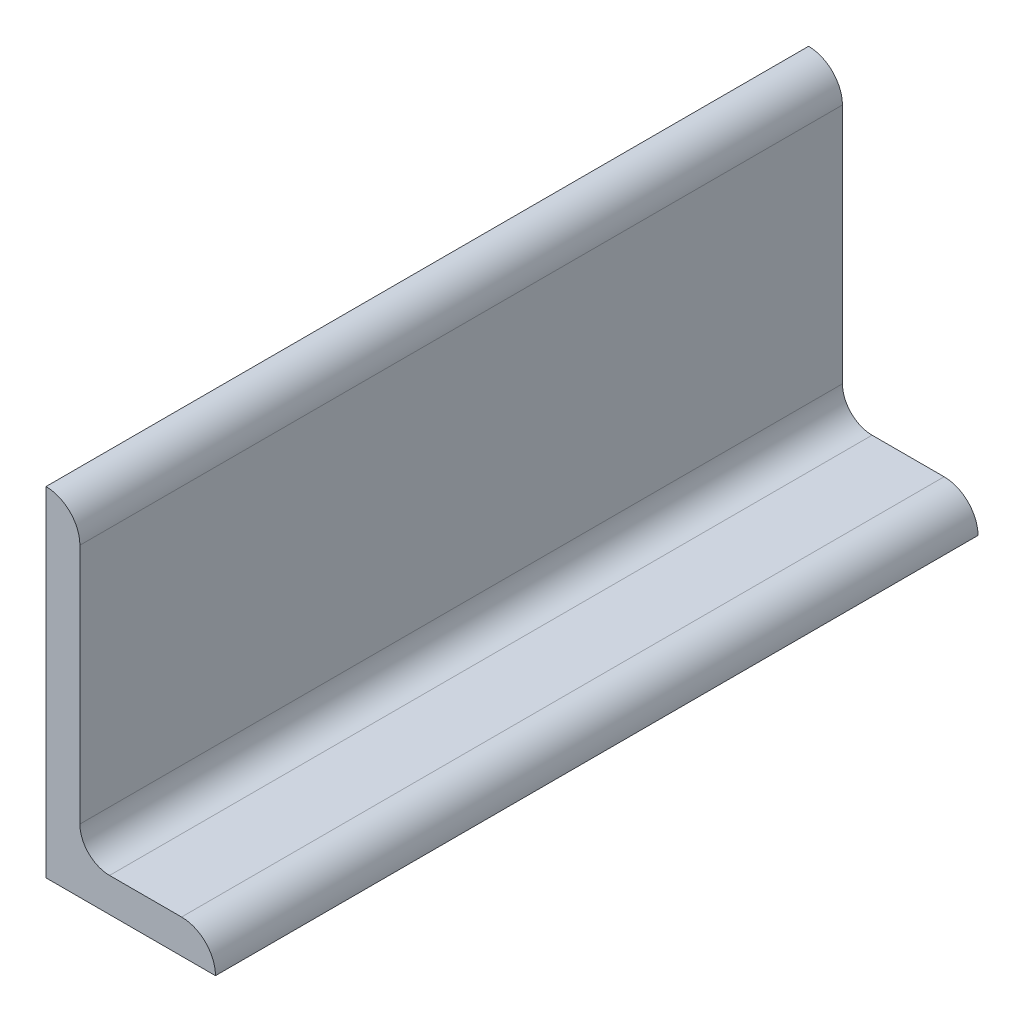
ISO-10303-21;
HEADER;
FILE_DESCRIPTION(('STEP AP214'),'2;1');
FILE_NAME('part.step','',(''),(''),'','','');
FILE_SCHEMA(('AUTOMOTIVE_DESIGN { 1 0 10303 214 1 1 1 1 }'));
ENDSEC;
DATA;
#1=APPLICATION_CONTEXT('core data for automotive mechanical design processes');
#2=APPLICATION_PROTOCOL_DEFINITION('international standard','automotive_design',2000,#1);
#3=PRODUCT_CONTEXT('',#1,'mechanical');
#4=PRODUCT('Part','Part','',(#3));
#5=PRODUCT_RELATED_PRODUCT_CATEGORY('part','',(#4));
#6=PRODUCT_DEFINITION_FORMATION('','',#4);
#7=PRODUCT_DEFINITION_CONTEXT('part definition',#1,'design');
#8=PRODUCT_DEFINITION('design','',#6,#7);
#9=PRODUCT_DEFINITION_SHAPE('','',#8);
#10=(LENGTH_UNIT() NAMED_UNIT(*) SI_UNIT(.MILLI.,.METRE.));
#11=(NAMED_UNIT(*) PLANE_ANGLE_UNIT() SI_UNIT($,.RADIAN.));
#12=(NAMED_UNIT(*) SI_UNIT($,.STERADIAN.) SOLID_ANGLE_UNIT());
#13=UNCERTAINTY_MEASURE_WITH_UNIT(LENGTH_MEASURE(1.E-05),#10,'distance_accuracy_value','');
#14=(GEOMETRIC_REPRESENTATION_CONTEXT(3) GLOBAL_UNCERTAINTY_ASSIGNED_CONTEXT((#13)) GLOBAL_UNIT_ASSIGNED_CONTEXT((#10,
#11,#12)) REPRESENTATION_CONTEXT('',''));
#15=CARTESIAN_POINT('',(0.,0.,0.));
#16=DIRECTION('',(0.,0.,1.));
#17=DIRECTION('',(1.,0.,0.));
#18=AXIS2_PLACEMENT_3D('',#15,#16,#17);
#19=CARTESIAN_POINT('',(40.,0.,90.));
#20=DIRECTION('',(0.,1.,0.));
#21=DIRECTION('',(-1.,0.,0.));
#22=AXIS2_PLACEMENT_3D('',#19,#20,#21);
#23=PLANE('',#22);
#24=DIRECTION('',(1.,0.,0.));
#25=VECTOR('',#24,1.);
#26=CARTESIAN_POINT('',(40.,0.,-90.));
#27=LINE('',#26,#25);
#28=CARTESIAN_POINT('',(0.,0.,-90.));
#29=VERTEX_POINT('',#28);
#30=CARTESIAN_POINT('',(40.,0.,-90.));
#31=VERTEX_POINT('',#30);
#32=EDGE_CURVE('E106',#29,#31,#27,.T.);
#33=ORIENTED_EDGE('',*,*,#32,.T.);
#34=DIRECTION('',(0.,0.,-1.));
#35=VECTOR('',#34,1.);
#36=CARTESIAN_POINT('',(40.,0.,90.));
#37=LINE('',#36,#35);
#38=CARTESIAN_POINT('',(40.,0.,90.));
#39=VERTEX_POINT('',#38);
#40=EDGE_CURVE('E104',#39,#31,#37,.T.);
#41=ORIENTED_EDGE('',*,*,#40,.F.);
#42=DIRECTION('',(1.,0.,0.));
#43=VECTOR('',#42,1.);
#44=CARTESIAN_POINT('',(40.,0.,90.));
#45=LINE('',#44,#43);
#46=CARTESIAN_POINT('',(0.,0.,90.));
#47=VERTEX_POINT('',#46);
#48=EDGE_CURVE('E91',#47,#39,#45,.T.);
#49=ORIENTED_EDGE('',*,*,#48,.F.);
#50=DIRECTION('',(0.,0.,-1.));
#51=VECTOR('',#50,1.);
#52=CARTESIAN_POINT('',(0.,0.,90.));
#53=LINE('',#52,#51);
#54=EDGE_CURVE('E126',#47,#29,#53,.T.);
#55=ORIENTED_EDGE('',*,*,#54,.T.);
#56=EDGE_LOOP('',(#33,#41,#49,#55));
#57=FACE_BOUND('',#56,.T.);
#58=ADVANCED_FACE('F32',(#57),#23,.F.);
#59=CARTESIAN_POINT('',(15.,7.99999999999999,90.));
#60=DIRECTION('',(0.,-1.,0.));
#61=DIRECTION('',(1.,0.,0.));
#62=AXIS2_PLACEMENT_3D('',#59,#60,#61);
#63=PLANE('',#62);
#64=DIRECTION('',(-1.,0.,0.));
#65=VECTOR('',#64,1.);
#66=CARTESIAN_POINT('',(15.,7.99999999999999,90.));
#67=LINE('',#66,#65);
#68=CARTESIAN_POINT('',(32.,7.99999999999999,90.));
#69=VERTEX_POINT('',#68);
#70=CARTESIAN_POINT('',(15.,7.99999999999999,90.));
#71=VERTEX_POINT('',#70);
#72=EDGE_CURVE('E99',#69,#71,#67,.T.);
#73=ORIENTED_EDGE('',*,*,#72,.F.);
#74=DIRECTION('',(0.,0.,-1.));
#75=VECTOR('',#74,1.);
#76=CARTESIAN_POINT('',(32.,7.99999999999999,90.));
#77=LINE('',#76,#75);
#78=CARTESIAN_POINT('',(32.,7.99999999999999,-90.));
#79=VERTEX_POINT('',#78);
#80=EDGE_CURVE('E11',#69,#79,#77,.T.);
#81=ORIENTED_EDGE('',*,*,#80,.T.);
#82=DIRECTION('',(-1.,0.,0.));
#83=VECTOR('',#82,1.);
#84=CARTESIAN_POINT('',(15.,7.99999999999999,-90.));
#85=LINE('',#84,#83);
#86=CARTESIAN_POINT('',(15.,7.99999999999999,-90.));
#87=VERTEX_POINT('',#86);
#88=EDGE_CURVE('E133',#79,#87,#85,.T.);
#89=ORIENTED_EDGE('',*,*,#88,.T.);
#90=DIRECTION('',(0.,0.,-1.));
#91=VECTOR('',#90,1.);
#92=CARTESIAN_POINT('',(15.,7.99999999999999,90.));
#93=LINE('',#92,#91);
#94=EDGE_CURVE('E109',#71,#87,#93,.T.);
#95=ORIENTED_EDGE('',*,*,#94,.F.);
#96=EDGE_LOOP('',(#73,#81,#89,#95));
#97=FACE_BOUND('',#96,.T.);
#98=ADVANCED_FACE('F145',(#97),#63,.F.);
#99=CARTESIAN_POINT('',(15.,15.,90.));
#100=DIRECTION('',(0.,0.,-1.));
#101=DIRECTION('',(-1.,0.,0.));
#102=AXIS2_PLACEMENT_3D('',#99,#100,#101);
#103=CYLINDRICAL_SURFACE('',#102,7.);
#104=CARTESIAN_POINT('',(15.,15.,-90.));
#105=DIRECTION('',(0.,0.,-1.));
#106=DIRECTION('',(-1.,0.,0.));
#107=AXIS2_PLACEMENT_3D('',#104,#105,#106);
#108=CIRCLE('',#107,7.);
#109=CARTESIAN_POINT('',(8.,15.,-90.));
#110=VERTEX_POINT('',#109);
#111=EDGE_CURVE('E131',#87,#110,#108,.T.);
#112=ORIENTED_EDGE('',*,*,#111,.T.);
#113=DIRECTION('',(0.,0.,-1.));
#114=VECTOR('',#113,1.);
#115=CARTESIAN_POINT('',(8.,15.,90.));
#116=LINE('',#115,#114);
#117=CARTESIAN_POINT('',(8.,15.,90.));
#118=VERTEX_POINT('',#117);
#119=EDGE_CURVE('E120',#118,#110,#116,.T.);
#120=ORIENTED_EDGE('',*,*,#119,.F.);
#121=CARTESIAN_POINT('',(15.,15.,90.));
#122=DIRECTION('',(0.,0.,-1.));
#123=DIRECTION('',(-1.,0.,0.));
#124=AXIS2_PLACEMENT_3D('',#121,#122,#123);
#125=CIRCLE('',#124,7.);
#126=EDGE_CURVE('E139',#71,#118,#125,.T.);
#127=ORIENTED_EDGE('',*,*,#126,.F.);
#128=ORIENTED_EDGE('',*,*,#94,.T.);
#129=EDGE_LOOP('',(#112,#120,#127,#128));
#130=FACE_BOUND('',#129,.T.);
#131=ADVANCED_FACE('F149',(#130),#103,.F.);
#132=CARTESIAN_POINT('',(8.,80.,90.));
#133=DIRECTION('',(-1.,0.,0.));
#134=DIRECTION('',(0.,-1.,0.));
#135=AXIS2_PLACEMENT_3D('',#132,#133,#134);
#136=PLANE('',#135);
#137=DIRECTION('',(0.,1.,0.));
#138=VECTOR('',#137,1.);
#139=CARTESIAN_POINT('',(8.,80.,-90.));
#140=LINE('',#139,#138);
#141=CARTESIAN_POINT('',(8.,72.,-90.));
#142=VERTEX_POINT('',#141);
#143=EDGE_CURVE('E129',#110,#142,#140,.T.);
#144=ORIENTED_EDGE('',*,*,#143,.T.);
#145=DIRECTION('',(0.,0.,-1.));
#146=VECTOR('',#145,1.);
#147=CARTESIAN_POINT('',(8.,72.,90.));
#148=LINE('',#147,#146);
#149=CARTESIAN_POINT('',(8.,72.,90.));
#150=VERTEX_POINT('',#149);
#151=EDGE_CURVE('E55',#142,#150,#148,.F.);
#152=ORIENTED_EDGE('',*,*,#151,.T.);
#153=DIRECTION('',(0.,1.,0.));
#154=VECTOR('',#153,1.);
#155=CARTESIAN_POINT('',(8.,80.,90.));
#156=LINE('',#155,#154);
#157=EDGE_CURVE('E137',#118,#150,#156,.T.);
#158=ORIENTED_EDGE('',*,*,#157,.F.);
#159=ORIENTED_EDGE('',*,*,#119,.T.);
#160=EDGE_LOOP('',(#144,#152,#158,#159));
#161=FACE_BOUND('',#160,.T.);
#162=ADVANCED_FACE('F151',(#161),#136,.F.);
#163=CARTESIAN_POINT('',(0.,80.,90.));
#164=DIRECTION('',(1.,0.,0.));
#165=DIRECTION('',(0.,1.,0.));
#166=AXIS2_PLACEMENT_3D('',#163,#164,#165);
#167=PLANE('',#166);
#168=DIRECTION('',(0.,-1.,0.));
#169=VECTOR('',#168,1.);
#170=CARTESIAN_POINT('',(0.,80.,-90.));
#171=LINE('',#170,#169);
#172=CARTESIAN_POINT('',(0.,80.,-90.));
#173=VERTEX_POINT('',#172);
#174=EDGE_CURVE('E100',#173,#29,#171,.T.);
#175=ORIENTED_EDGE('',*,*,#174,.T.);
#176=ORIENTED_EDGE('',*,*,#54,.F.);
#177=DIRECTION('',(0.,-1.,0.));
#178=VECTOR('',#177,1.);
#179=CARTESIAN_POINT('',(0.,80.,90.));
#180=LINE('',#179,#178);
#181=CARTESIAN_POINT('',(0.,80.,90.));
#182=VERTEX_POINT('',#181);
#183=EDGE_CURVE('E95',#182,#47,#180,.T.);
#184=ORIENTED_EDGE('',*,*,#183,.F.);
#185=DIRECTION('',(0.,0.,-1.));
#186=VECTOR('',#185,1.);
#187=CARTESIAN_POINT('',(0.,80.,90.));
#188=LINE('',#187,#186);
#189=EDGE_CURVE('E123',#182,#173,#188,.T.);
#190=ORIENTED_EDGE('',*,*,#189,.T.);
#191=EDGE_LOOP('',(#175,#176,#184,#190));
#192=FACE_BOUND('',#191,.T.);
#193=ADVANCED_FACE('F158',(#192),#167,.F.);
#194=CARTESIAN_POINT('',(15.,15.,90.));
#195=DIRECTION('',(0.,0.,-1.));
#196=DIRECTION('',(-1.,0.,0.));
#197=AXIS2_PLACEMENT_3D('',#194,#195,#196);
#198=PLANE('',#197);
#199=ORIENTED_EDGE('',*,*,#157,.T.);
#200=CARTESIAN_POINT('',(0.,72.,90.));
#201=DIRECTION('',(0.,0.,-1.));
#202=DIRECTION('',(-1.,0.,0.));
#203=AXIS2_PLACEMENT_3D('',#200,#201,#202);
#204=CIRCLE('',#203,8.);
#205=EDGE_CURVE('E40',#150,#182,#204,.F.);
#206=ORIENTED_EDGE('',*,*,#205,.T.);
#207=ORIENTED_EDGE('',*,*,#183,.T.);
#208=ORIENTED_EDGE('',*,*,#48,.T.);
#209=CARTESIAN_POINT('',(32.,0.,90.));
#210=DIRECTION('',(0.,0.,-1.));
#211=DIRECTION('',(-1.,0.,0.));
#212=AXIS2_PLACEMENT_3D('',#209,#210,#211);
#213=CIRCLE('',#212,8.);
#214=EDGE_CURVE('E47',#39,#69,#213,.F.);
#215=ORIENTED_EDGE('',*,*,#214,.T.);
#216=ORIENTED_EDGE('',*,*,#72,.T.);
#217=ORIENTED_EDGE('',*,*,#126,.T.);
#218=EDGE_LOOP('',(#199,#206,#207,#208,#215,#216,#217));
#219=FACE_BOUND('',#218,.T.);
#220=ADVANCED_FACE('F93',(#219),#198,.F.);
#221=CARTESIAN_POINT('',(15.,15.,-90.));
#222=DIRECTION('',(0.,0.,-1.));
#223=DIRECTION('',(-1.,0.,0.));
#224=AXIS2_PLACEMENT_3D('',#221,#222,#223);
#225=PLANE('',#224);
#226=ORIENTED_EDGE('',*,*,#174,.F.);
#227=CARTESIAN_POINT('',(0.,72.,-90.));
#228=DIRECTION('',(0.,0.,-1.));
#229=DIRECTION('',(-1.,0.,0.));
#230=AXIS2_PLACEMENT_3D('',#227,#228,#229);
#231=CIRCLE('',#230,8.);
#232=EDGE_CURVE('E113',#173,#142,#231,.T.);
#233=ORIENTED_EDGE('',*,*,#232,.T.);
#234=ORIENTED_EDGE('',*,*,#143,.F.);
#235=ORIENTED_EDGE('',*,*,#111,.F.);
#236=ORIENTED_EDGE('',*,*,#88,.F.);
#237=CARTESIAN_POINT('',(32.,0.,-90.));
#238=DIRECTION('',(0.,0.,-1.));
#239=DIRECTION('',(-1.,0.,0.));
#240=AXIS2_PLACEMENT_3D('',#237,#238,#239);
#241=CIRCLE('',#240,8.);
#242=EDGE_CURVE('E108',#79,#31,#241,.T.);
#243=ORIENTED_EDGE('',*,*,#242,.T.);
#244=ORIENTED_EDGE('',*,*,#32,.F.);
#245=EDGE_LOOP('',(#226,#233,#234,#235,#236,#243,#244));
#246=FACE_BOUND('',#245,.T.);
#247=ADVANCED_FACE('F160',(#246),#225,.T.);
#248=CARTESIAN_POINT('',(0.,72.,90.));
#249=DIRECTION('',(0.,0.,-1.));
#250=DIRECTION('',(-1.,0.,0.));
#251=AXIS2_PLACEMENT_3D('',#248,#249,#250);
#252=CYLINDRICAL_SURFACE('',#251,8.);
#253=ORIENTED_EDGE('',*,*,#205,.F.);
#254=ORIENTED_EDGE('',*,*,#151,.F.);
#255=ORIENTED_EDGE('',*,*,#232,.F.);
#256=ORIENTED_EDGE('',*,*,#189,.F.);
#257=EDGE_LOOP('',(#253,#254,#255,#256));
#258=FACE_BOUND('',#257,.T.);
#259=ADVANCED_FACE('F155',(#258),#252,.T.);
#260=CARTESIAN_POINT('',(32.,0.,90.));
#261=DIRECTION('',(0.,0.,-1.));
#262=DIRECTION('',(-1.,0.,0.));
#263=AXIS2_PLACEMENT_3D('',#260,#261,#262);
#264=CYLINDRICAL_SURFACE('',#263,8.);
#265=ORIENTED_EDGE('',*,*,#214,.F.);
#266=ORIENTED_EDGE('',*,*,#40,.T.);
#267=ORIENTED_EDGE('',*,*,#242,.F.);
#268=ORIENTED_EDGE('',*,*,#80,.F.);
#269=EDGE_LOOP('',(#265,#266,#267,#268));
#270=FACE_BOUND('',#269,.T.);
#271=ADVANCED_FACE('F34',(#270),#264,.T.);
#272=CLOSED_SHELL('',(#58,#98,#131,#162,#193,#220,#247,#259,#271));
#273=MANIFOLD_SOLID_BREP('B2',#272);
#274=ADVANCED_BREP_SHAPE_REPRESENTATION('',(#18,#273),#14);
#275=SHAPE_DEFINITION_REPRESENTATION(#9,#274);
ENDSEC;
END-ISO-10303-21;
